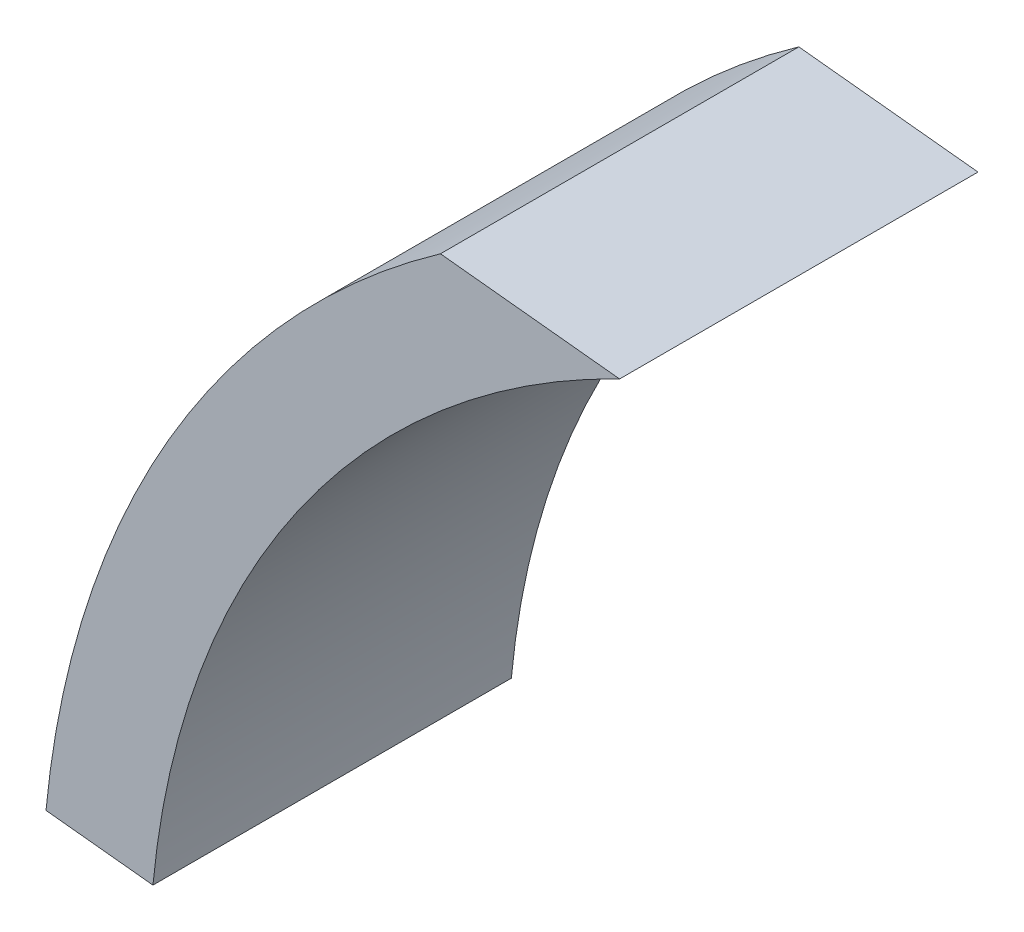
ISO-10303-21;
HEADER;
FILE_DESCRIPTION(('STEP AP214'),'2;1');
FILE_NAME('part.step','',(''),(''),'','','');
FILE_SCHEMA(('AUTOMOTIVE_DESIGN { 1 0 10303 214 1 1 1 1 }'));
ENDSEC;
DATA;
#1=APPLICATION_CONTEXT('core data for automotive mechanical design processes');
#2=APPLICATION_PROTOCOL_DEFINITION('international standard','automotive_design',2000,#1);
#3=PRODUCT_CONTEXT('',#1,'mechanical');
#4=PRODUCT('Part','Part','',(#3));
#5=PRODUCT_RELATED_PRODUCT_CATEGORY('part','',(#4));
#6=PRODUCT_DEFINITION_FORMATION('','',#4);
#7=PRODUCT_DEFINITION_CONTEXT('part definition',#1,'design');
#8=PRODUCT_DEFINITION('design','',#6,#7);
#9=PRODUCT_DEFINITION_SHAPE('','',#8);
#10=(LENGTH_UNIT() NAMED_UNIT(*) SI_UNIT(.MILLI.,.METRE.));
#11=(NAMED_UNIT(*) PLANE_ANGLE_UNIT() SI_UNIT($,.RADIAN.));
#12=(NAMED_UNIT(*) SI_UNIT($,.STERADIAN.) SOLID_ANGLE_UNIT());
#13=UNCERTAINTY_MEASURE_WITH_UNIT(LENGTH_MEASURE(1.E-05),#10,'distance_accuracy_value','');
#14=(GEOMETRIC_REPRESENTATION_CONTEXT(3) GLOBAL_UNCERTAINTY_ASSIGNED_CONTEXT((#13)) GLOBAL_UNIT_ASSIGNED_CONTEXT((#10,
#11,#12)) REPRESENTATION_CONTEXT('',''));
#15=CARTESIAN_POINT('',(0.,0.,0.));
#16=DIRECTION('',(0.,0.,1.));
#17=DIRECTION('',(1.,0.,0.));
#18=AXIS2_PLACEMENT_3D('',#15,#16,#17);
#19=CARTESIAN_POINT('',(0.,0.,6.15));
#20=DIRECTION('',(0.,0.,1.));
#21=DIRECTION('',(1.,0.,0.));
#22=AXIS2_PLACEMENT_3D('',#19,#20,#21);
#23=PLANE('',#22);
#24=DIRECTION('',(0.994521895368273,-0.104528463267654,0.));
#25=VECTOR('',#24,1.);
#26=CARTESIAN_POINT('',(0.826031073261367,7.85916068152122,6.15));
#27=LINE('',#26,#25);
#28=CARTESIAN_POINT('',(-6.04994012159409,8.58185437566532,6.15));
#29=VERTEX_POINT('',#28);
#30=CARTESIAN_POINT('',(-4.05029811740699,8.37168353201012,6.15));
#31=VERTEX_POINT('',#30);
#32=EDGE_CURVE('E51',#29,#31,#27,.T.);
#33=ORIENTED_EDGE('',*,*,#32,.F.);
#34=CARTESIAN_POINT('',(0.,0.,6.15));
#35=DIRECTION('',(0.,0.,1.));
#36=DIRECTION('',(1.,0.,0.));
#37=AXIS2_PLACEMENT_3D('',#34,#35,#36);
#38=CIRCLE('',#37,10.5);
#39=CARTESIAN_POINT('',(-10.452225874404,1.00048701662726,6.15));
#40=VERTEX_POINT('',#39);
#41=EDGE_CURVE('E113',#29,#40,#38,.T.);
#42=ORIENTED_EDGE('',*,*,#41,.T.);
#43=DIRECTION('',(-0.994521895368273,0.104528463267654,0.));
#44=VECTOR('',#43,1.);
#45=CARTESIAN_POINT('',(-0.0101966328798677,-0.0970144814249705,6.15));
#46=LINE('',#45,#44);
#47=CARTESIAN_POINT('',(-9.25874144728863,0.875046748613809,6.15));
#48=VERTEX_POINT('',#47);
#49=EDGE_CURVE('E117',#48,#40,#46,.T.);
#50=ORIENTED_EDGE('',*,*,#49,.F.);
#51=CARTESIAN_POINT('',(0.,0.,6.15));
#52=DIRECTION('',(0.,0.,-1.));
#53=DIRECTION('',(1.,0.,0.));
#54=AXIS2_PLACEMENT_3D('',#51,#52,#53);
#55=CIRCLE('',#54,9.3);
#56=EDGE_CURVE('E90',#48,#31,#55,.T.);
#57=ORIENTED_EDGE('',*,*,#56,.T.);
#58=EDGE_LOOP('',(#33,#42,#50,#57));
#59=FACE_BOUND('',#58,.T.);
#60=ADVANCED_FACE('F42',(#59),#23,.T.);
#61=CARTESIAN_POINT('',(0.,0.,6.15));
#62=DIRECTION('',(0.,0.,-1.));
#63=DIRECTION('',(-1.,0.,0.));
#64=AXIS2_PLACEMENT_3D('',#61,#62,#63);
#65=CYLINDRICAL_SURFACE('',#64,10.5);
#66=ORIENTED_EDGE('',*,*,#41,.F.);
#67=DIRECTION('',(0.,0.,-1.));
#68=VECTOR('',#67,1.);
#69=CARTESIAN_POINT('',(-6.04994012159409,8.58185437566533,6.15));
#70=LINE('',#69,#68);
#71=CARTESIAN_POINT('',(-6.04994012159409,8.58185437566532,2.15));
#72=VERTEX_POINT('',#71);
#73=EDGE_CURVE('E101',#29,#72,#70,.T.);
#74=ORIENTED_EDGE('',*,*,#73,.T.);
#75=CARTESIAN_POINT('',(0.,0.,2.15));
#76=DIRECTION('',(0.,0.,1.));
#77=DIRECTION('',(1.,0.,0.));
#78=AXIS2_PLACEMENT_3D('',#75,#76,#77);
#79=CIRCLE('',#78,10.5);
#80=CARTESIAN_POINT('',(-10.452225874404,1.00048701662726,2.15));
#81=VERTEX_POINT('',#80);
#82=EDGE_CURVE('E11',#72,#81,#79,.T.);
#83=ORIENTED_EDGE('',*,*,#82,.T.);
#84=DIRECTION('',(0.,0.,-1.));
#85=VECTOR('',#84,1.);
#86=CARTESIAN_POINT('',(-10.452225874404,1.00048701662726,6.15));
#87=LINE('',#86,#85);
#88=EDGE_CURVE('E95',#81,#40,#87,.F.);
#89=ORIENTED_EDGE('',*,*,#88,.T.);
#90=EDGE_LOOP('',(#66,#74,#83,#89));
#91=FACE_BOUND('',#90,.T.);
#92=ADVANCED_FACE('F126',(#91),#65,.T.);
#93=CARTESIAN_POINT('',(0.,0.,6.15));
#94=DIRECTION('',(0.,0.,-1.));
#95=DIRECTION('',(-1.,0.,0.));
#96=AXIS2_PLACEMENT_3D('',#93,#94,#95);
#97=CYLINDRICAL_SURFACE('',#96,9.3);
#98=CARTESIAN_POINT('',(0.,0.,2.15));
#99=DIRECTION('',(0.,0.,1.));
#100=DIRECTION('',(1.,0.,0.));
#101=AXIS2_PLACEMENT_3D('',#98,#99,#100);
#102=CIRCLE('',#101,9.3);
#103=CARTESIAN_POINT('',(-9.25874144728863,0.875046748613807,2.15));
#104=VERTEX_POINT('',#103);
#105=CARTESIAN_POINT('',(-4.05029811740699,8.37168353201012,2.15));
#106=VERTEX_POINT('',#105);
#107=EDGE_CURVE('E83',#104,#106,#102,.F.);
#108=ORIENTED_EDGE('',*,*,#107,.T.);
#109=DIRECTION('',(0.,0.,-1.));
#110=VECTOR('',#109,1.);
#111=CARTESIAN_POINT('',(-4.05029811740699,8.37168353201012,6.15));
#112=LINE('',#111,#110);
#113=EDGE_CURVE('E91',#106,#31,#112,.F.);
#114=ORIENTED_EDGE('',*,*,#113,.T.);
#115=ORIENTED_EDGE('',*,*,#56,.F.);
#116=DIRECTION('',(0.,0.,-1.));
#117=VECTOR('',#116,1.);
#118=CARTESIAN_POINT('',(-9.25874144728863,0.875046748613809,6.15));
#119=LINE('',#118,#117);
#120=EDGE_CURVE('E58',#48,#104,#119,.T.);
#121=ORIENTED_EDGE('',*,*,#120,.T.);
#122=EDGE_LOOP('',(#108,#114,#115,#121));
#123=FACE_BOUND('',#122,.T.);
#124=ADVANCED_FACE('F44',(#123),#97,.F.);
#125=CARTESIAN_POINT('',(11.1544143545613,6.77360385520938,6.15));
#126=DIRECTION('',(-0.104528463267654,-0.994521895368273,0.));
#127=DIRECTION('',(0.994521895368273,-0.104528463267654,0.));
#128=AXIS2_PLACEMENT_3D('',#125,#126,#127);
#129=PLANE('',#128);
#130=DIRECTION('',(-0.994521895368273,0.104528463267654,0.));
#131=VECTOR('',#130,1.);
#132=CARTESIAN_POINT('',(11.1544143545613,6.77360385520938,2.15));
#133=LINE('',#132,#131);
#134=EDGE_CURVE('E86',#106,#72,#133,.T.);
#135=ORIENTED_EDGE('',*,*,#134,.T.);
#136=ORIENTED_EDGE('',*,*,#73,.F.);
#137=ORIENTED_EDGE('',*,*,#32,.T.);
#138=ORIENTED_EDGE('',*,*,#113,.F.);
#139=EDGE_LOOP('',(#135,#136,#137,#138));
#140=FACE_BOUND('',#139,.T.);
#141=ADVANCED_FACE('F122',(#140),#129,.F.);
#142=CARTESIAN_POINT('',(10.3181866484201,-1.18257130773681,6.15));
#143=DIRECTION('',(0.104528463267654,0.994521895368273,0.));
#144=DIRECTION('',(-0.994521895368273,0.104528463267654,0.));
#145=AXIS2_PLACEMENT_3D('',#142,#143,#144);
#146=PLANE('',#145);
#147=ORIENTED_EDGE('',*,*,#49,.T.);
#148=ORIENTED_EDGE('',*,*,#88,.F.);
#149=DIRECTION('',(-0.994521895368273,0.104528463267654,0.));
#150=VECTOR('',#149,1.);
#151=CARTESIAN_POINT('',(10.3181866484201,-1.18257130773681,2.15));
#152=LINE('',#151,#150);
#153=EDGE_CURVE('E85',#104,#81,#152,.T.);
#154=ORIENTED_EDGE('',*,*,#153,.F.);
#155=ORIENTED_EDGE('',*,*,#120,.F.);
#156=EDGE_LOOP('',(#147,#148,#154,#155));
#157=FACE_BOUND('',#156,.T.);
#158=ADVANCED_FACE('F93',(#157),#146,.F.);
#159=CARTESIAN_POINT('',(10.3181866484201,-1.18257130773681,2.15));
#160=DIRECTION('',(0.,0.,1.));
#161=DIRECTION('',(1.,0.,0.));
#162=AXIS2_PLACEMENT_3D('',#159,#160,#161);
#163=PLANE('',#162);
#164=ORIENTED_EDGE('',*,*,#153,.T.);
#165=ORIENTED_EDGE('',*,*,#82,.F.);
#166=ORIENTED_EDGE('',*,*,#134,.F.);
#167=ORIENTED_EDGE('',*,*,#107,.F.);
#168=EDGE_LOOP('',(#164,#165,#166,#167));
#169=FACE_BOUND('',#168,.T.);
#170=ADVANCED_FACE('F84',(#169),#163,.F.);
#171=CLOSED_SHELL('',(#60,#92,#124,#141,#158,#170));
#172=MANIFOLD_SOLID_BREP('B2',#171);
#173=ADVANCED_BREP_SHAPE_REPRESENTATION('',(#18,#172),#14);
#174=SHAPE_DEFINITION_REPRESENTATION(#9,#173);
ENDSEC;
END-ISO-10303-21;
